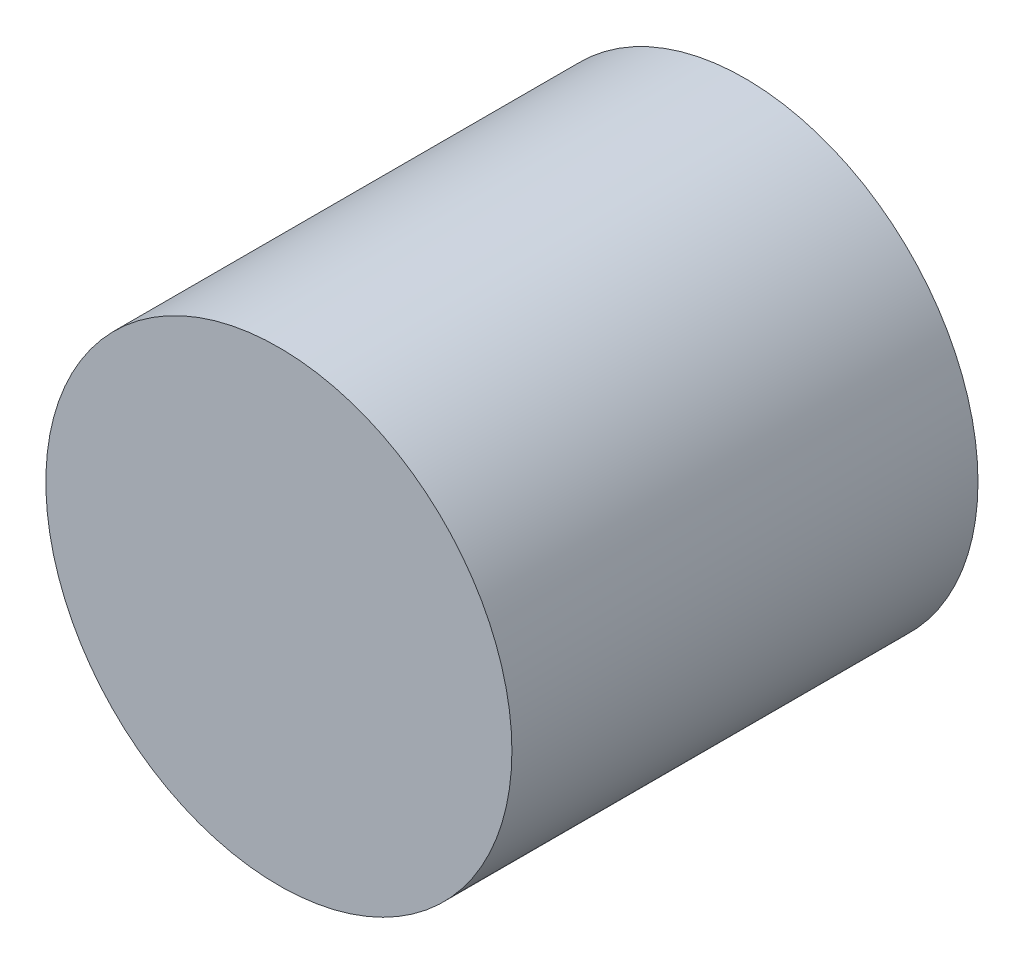
ISO-10303-21;
HEADER;
FILE_DESCRIPTION(('STEP AP214'),'2;1');
FILE_NAME('part.step','',(''),(''),'','','');
FILE_SCHEMA(('AUTOMOTIVE_DESIGN { 1 0 10303 214 1 1 1 1 }'));
ENDSEC;
DATA;
#1=APPLICATION_CONTEXT('core data for automotive mechanical design processes');
#2=APPLICATION_PROTOCOL_DEFINITION('international standard','automotive_design',2000,#1);
#3=PRODUCT_CONTEXT('',#1,'mechanical');
#4=PRODUCT('Part','Part','',(#3));
#5=PRODUCT_RELATED_PRODUCT_CATEGORY('part','',(#4));
#6=PRODUCT_DEFINITION_FORMATION('','',#4);
#7=PRODUCT_DEFINITION_CONTEXT('part definition',#1,'design');
#8=PRODUCT_DEFINITION('design','',#6,#7);
#9=PRODUCT_DEFINITION_SHAPE('','',#8);
#10=(LENGTH_UNIT() NAMED_UNIT(*) SI_UNIT(.MILLI.,.METRE.));
#11=(NAMED_UNIT(*) PLANE_ANGLE_UNIT() SI_UNIT($,.RADIAN.));
#12=(NAMED_UNIT(*) SI_UNIT($,.STERADIAN.) SOLID_ANGLE_UNIT());
#13=UNCERTAINTY_MEASURE_WITH_UNIT(LENGTH_MEASURE(1.E-05),#10,'distance_accuracy_value','');
#14=(GEOMETRIC_REPRESENTATION_CONTEXT(3) GLOBAL_UNCERTAINTY_ASSIGNED_CONTEXT((#13)) GLOBAL_UNIT_ASSIGNED_CONTEXT((#10,
#11,#12)) REPRESENTATION_CONTEXT('',''));
#15=CARTESIAN_POINT('',(0.,0.,0.));
#16=DIRECTION('',(0.,0.,1.));
#17=DIRECTION('',(1.,0.,0.));
#18=AXIS2_PLACEMENT_3D('',#15,#16,#17);
#19=CARTESIAN_POINT('',(0.,0.,20.));
#20=DIRECTION('',(0.,0.,-1.));
#21=DIRECTION('',(-1.,0.,0.));
#22=AXIS2_PLACEMENT_3D('',#19,#20,#21);
#23=CYLINDRICAL_SURFACE('',#22,10.);
#24=CARTESIAN_POINT('',(0.,0.,20.));
#25=DIRECTION('',(0.,0.,1.));
#26=DIRECTION('',(1.,0.,0.));
#27=AXIS2_PLACEMENT_3D('',#24,#25,#26);
#28=CIRCLE('',#27,10.);
#29=CARTESIAN_POINT('',(10.,0.,20.));
#30=VERTEX_POINT('',#29);
#31=EDGE_CURVE('E10',#30,#30,#28,.T.);
#32=ORIENTED_EDGE('',*,*,#31,.F.);
#33=EDGE_LOOP('',(#32));
#34=FACE_BOUND('',#33,.T.);
#35=CARTESIAN_POINT('',(0.,0.,0.));
#36=DIRECTION('',(0.,0.,1.));
#37=DIRECTION('',(1.,0.,0.));
#38=AXIS2_PLACEMENT_3D('',#35,#36,#37);
#39=CIRCLE('',#38,10.);
#40=CARTESIAN_POINT('',(10.,0.,0.));
#41=VERTEX_POINT('',#40);
#42=EDGE_CURVE('E40',#41,#41,#39,.T.);
#43=ORIENTED_EDGE('',*,*,#42,.T.);
#44=EDGE_LOOP('',(#43));
#45=FACE_BOUND('',#44,.T.);
#46=ADVANCED_FACE('F37',(#34,#45),#23,.T.);
#47=CARTESIAN_POINT('',(0.,0.,20.));
#48=DIRECTION('',(0.,0.,1.));
#49=DIRECTION('',(1.,0.,0.));
#50=AXIS2_PLACEMENT_3D('',#47,#48,#49);
#51=PLANE('',#50);
#52=ORIENTED_EDGE('',*,*,#31,.T.);
#53=EDGE_LOOP('',(#52));
#54=FACE_BOUND('',#53,.T.);
#55=ADVANCED_FACE('F54',(#54),#51,.T.);
#56=CARTESIAN_POINT('',(0.,0.,0.));
#57=DIRECTION('',(0.,0.,1.));
#58=DIRECTION('',(1.,0.,0.));
#59=AXIS2_PLACEMENT_3D('',#56,#57,#58);
#60=PLANE('',#59);
#61=ORIENTED_EDGE('',*,*,#42,.F.);
#62=EDGE_LOOP('',(#61));
#63=FACE_BOUND('',#62,.T.);
#64=ADVANCED_FACE('F52',(#63),#60,.F.);
#65=CLOSED_SHELL('',(#46,#55,#64));
#66=MANIFOLD_SOLID_BREP('B2',#65);
#67=ADVANCED_BREP_SHAPE_REPRESENTATION('',(#18,#66),#14);
#68=SHAPE_DEFINITION_REPRESENTATION(#9,#67);
ENDSEC;
END-ISO-10303-21;
